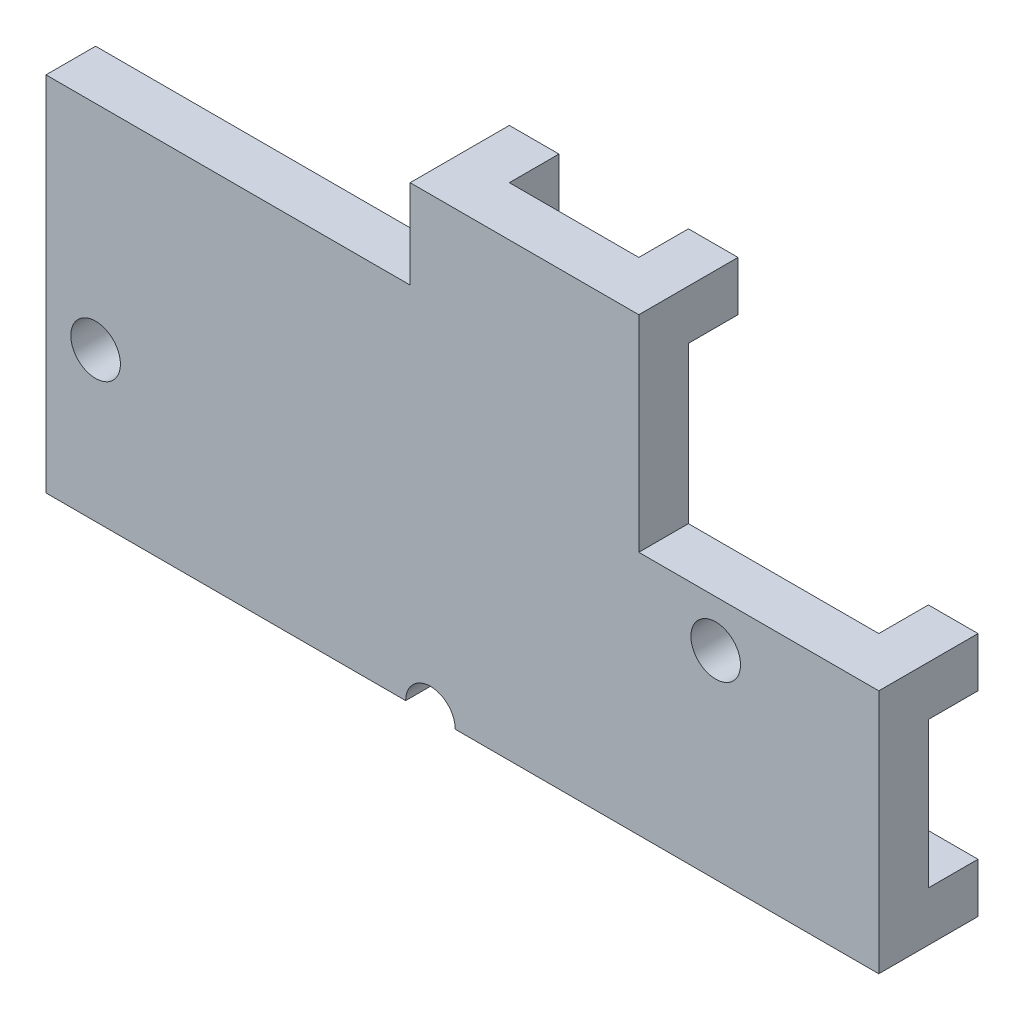
ISO-10303-21;
HEADER;
FILE_DESCRIPTION(('STEP AP214'),'2;1');
FILE_NAME('part.step','',(''),(''),'','','');
FILE_SCHEMA(('AUTOMOTIVE_DESIGN { 1 0 10303 214 1 1 1 1 }'));
ENDSEC;
DATA;
#1=APPLICATION_CONTEXT('core data for automotive mechanical design processes');
#2=APPLICATION_PROTOCOL_DEFINITION('international standard','automotive_design',2000,#1);
#3=PRODUCT_CONTEXT('',#1,'mechanical');
#4=PRODUCT('Part','Part','',(#3));
#5=PRODUCT_RELATED_PRODUCT_CATEGORY('part','',(#4));
#6=PRODUCT_DEFINITION_FORMATION('','',#4);
#7=PRODUCT_DEFINITION_CONTEXT('part definition',#1,'design');
#8=PRODUCT_DEFINITION('design','',#6,#7);
#9=PRODUCT_DEFINITION_SHAPE('','',#8);
#10=(LENGTH_UNIT() NAMED_UNIT(*) SI_UNIT(.MILLI.,.METRE.));
#11=(NAMED_UNIT(*) PLANE_ANGLE_UNIT() SI_UNIT($,.RADIAN.));
#12=(NAMED_UNIT(*) SI_UNIT($,.STERADIAN.) SOLID_ANGLE_UNIT());
#13=UNCERTAINTY_MEASURE_WITH_UNIT(LENGTH_MEASURE(1.E-05),#10,'distance_accuracy_value','');
#14=(GEOMETRIC_REPRESENTATION_CONTEXT(3) GLOBAL_UNCERTAINTY_ASSIGNED_CONTEXT((#13)) GLOBAL_UNIT_ASSIGNED_CONTEXT((#10,
#11,#12)) REPRESENTATION_CONTEXT('',''));
#15=CARTESIAN_POINT('',(0.,0.,0.));
#16=DIRECTION('',(0.,0.,1.));
#17=DIRECTION('',(1.,0.,0.));
#18=AXIS2_PLACEMENT_3D('',#15,#16,#17);
#19=CARTESIAN_POINT('',(0.,0.,0.));
#20=DIRECTION('',(0.,0.,1.));
#21=DIRECTION('',(1.,0.,0.));
#22=AXIS2_PLACEMENT_3D('',#19,#20,#21);
#23=PLANE('',#22);
#24=CARTESIAN_POINT('',(94.0727074553924,-6.0260802055856,0.));
#25=DIRECTION('',(0.,0.,-1.));
#26=DIRECTION('',(-1.,0.,0.));
#27=AXIS2_PLACEMENT_3D('',#24,#25,#26);
#28=CIRCLE('',#27,0.499999999999999);
#29=CARTESIAN_POINT('',(93.5727074553924,-6.0260802055856,0.));
#30=VERTEX_POINT('',#29);
#31=EDGE_CURVE('E279',#30,#30,#28,.T.);
#32=ORIENTED_EDGE('',*,*,#31,.F.);
#33=EDGE_LOOP('',(#32));
#34=FACE_BOUND('',#33,.T.);
#35=CARTESIAN_POINT('',(81.5727074553924,-7.0260802055856,0.));
#36=DIRECTION('',(0.,0.,-1.));
#37=DIRECTION('',(-1.,0.,0.));
#38=AXIS2_PLACEMENT_3D('',#35,#36,#37);
#39=CIRCLE('',#38,0.499999999999999);
#40=CARTESIAN_POINT('',(81.0727074553924,-7.0260802055856,0.));
#41=VERTEX_POINT('',#40);
#42=EDGE_CURVE('E296',#41,#41,#39,.T.);
#43=ORIENTED_EDGE('',*,*,#42,.F.);
#44=EDGE_LOOP('',(#43));
#45=FACE_BOUND('',#44,.T.);
#46=DIRECTION('',(0.,1.,0.));
#47=VECTOR('',#46,1.);
#48=CARTESIAN_POINT('',(96.3601074553924,-9.0260802055856,0.));
#49=LINE('',#48,#47);
#50=CARTESIAN_POINT('',(96.3601074553924,-10.0260802055856,0.));
#51=VERTEX_POINT('',#50);
#52=CARTESIAN_POINT('',(96.3601074553924,-9.0260802055856,0.));
#53=VERTEX_POINT('',#52);
#54=EDGE_CURVE('E204',#51,#53,#49,.T.);
#55=ORIENTED_EDGE('',*,*,#54,.F.);
#56=DIRECTION('',(1.,0.,0.));
#57=VECTOR('',#56,1.);
#58=CARTESIAN_POINT('',(80.5727074553924,-10.0260802055856,0.));
#59=LINE('',#58,#57);
#60=CARTESIAN_POINT('',(88.8227074553924,-10.0260802055856,0.));
#61=VERTEX_POINT('',#60);
#62=EDGE_CURVE('E355',#61,#51,#59,.T.);
#63=ORIENTED_EDGE('',*,*,#62,.F.);
#64=CARTESIAN_POINT('',(88.3227074553924,-10.0260802055856,0.));
#65=DIRECTION('',(0.,0.,-1.));
#66=DIRECTION('',(-1.,0.,0.));
#67=AXIS2_PLACEMENT_3D('',#64,#65,#66);
#68=CIRCLE('',#67,0.499999999999999);
#69=CARTESIAN_POINT('',(87.8227074553924,-10.0260802055856,0.));
#70=VERTEX_POINT('',#69);
#71=EDGE_CURVE('E284',#70,#61,#68,.T.);
#72=ORIENTED_EDGE('',*,*,#71,.F.);
#73=CARTESIAN_POINT('',(80.5727074553924,-10.0260802055856,0.));
#74=VERTEX_POINT('',#73);
#75=EDGE_CURVE('E356',#74,#70,#59,.T.);
#76=ORIENTED_EDGE('',*,*,#75,.F.);
#77=DIRECTION('',(0.,-1.,0.));
#78=VECTOR('',#77,1.);
#79=CARTESIAN_POINT('',(80.5727074553924,-2.7260802055856,0.));
#80=LINE('',#79,#78);
#81=CARTESIAN_POINT('',(80.5727074553924,-2.7260802055856,0.));
#82=VERTEX_POINT('',#81);
#83=EDGE_CURVE('E342',#82,#74,#80,.T.);
#84=ORIENTED_EDGE('',*,*,#83,.F.);
#85=DIRECTION('',(-1.,0.,0.));
#86=VECTOR('',#85,1.);
#87=CARTESIAN_POINT('',(80.5727074553924,-2.7260802055856,0.));
#88=LINE('',#87,#86);
#89=CARTESIAN_POINT('',(87.9127074553924,-2.7260802055856,0.));
#90=VERTEX_POINT('',#89);
#91=EDGE_CURVE('E347',#90,#82,#88,.T.);
#92=ORIENTED_EDGE('',*,*,#91,.F.);
#93=DIRECTION('',(0.,-1.,0.));
#94=VECTOR('',#93,1.);
#95=CARTESIAN_POINT('',(87.9127074553924,-0.938680205585596,0.));
#96=LINE('',#95,#94);
#97=CARTESIAN_POINT('',(87.9127074553924,-1.9386802055856,0.));
#98=VERTEX_POINT('',#97);
#99=EDGE_CURVE('E318',#98,#90,#96,.T.);
#100=ORIENTED_EDGE('',*,*,#99,.F.);
#101=DIRECTION('',(-1.,0.,0.));
#102=VECTOR('',#101,1.);
#103=CARTESIAN_POINT('',(87.9127074553924,-1.9386802055856,0.));
#104=LINE('',#103,#102);
#105=CARTESIAN_POINT('',(88.9127074553924,-1.9386802055856,0.));
#106=VERTEX_POINT('',#105);
#107=EDGE_CURVE('E239',#106,#98,#104,.T.);
#108=ORIENTED_EDGE('',*,*,#107,.F.);
#109=DIRECTION('',(0.,-1.,0.));
#110=VECTOR('',#109,1.);
#111=CARTESIAN_POINT('',(88.9127074553924,-1.9386802055856,0.));
#112=LINE('',#111,#110);
#113=CARTESIAN_POINT('',(88.9127074553924,-0.938680205585596,0.));
#114=VERTEX_POINT('',#113);
#115=EDGE_CURVE('E234',#114,#106,#112,.T.);
#116=ORIENTED_EDGE('',*,*,#115,.F.);
#117=DIRECTION('',(-1.,0.,0.));
#118=VECTOR('',#117,1.);
#119=CARTESIAN_POINT('',(92.5227074553924,-0.938680205585596,0.));
#120=LINE('',#119,#118);
#121=CARTESIAN_POINT('',(91.5227074553924,-0.938680205585596,0.));
#122=VERTEX_POINT('',#121);
#123=EDGE_CURVE('E305',#122,#114,#120,.T.);
#124=ORIENTED_EDGE('',*,*,#123,.F.);
#125=DIRECTION('',(0.,1.,0.));
#126=VECTOR('',#125,1.);
#127=CARTESIAN_POINT('',(91.5227074553924,-1.9386802055856,0.));
#128=LINE('',#127,#126);
#129=CARTESIAN_POINT('',(91.5227074553924,-1.9386802055856,0.));
#130=VERTEX_POINT('',#129);
#131=EDGE_CURVE('E256',#130,#122,#128,.T.);
#132=ORIENTED_EDGE('',*,*,#131,.F.);
#133=DIRECTION('',(-1.,0.,0.));
#134=VECTOR('',#133,1.);
#135=CARTESIAN_POINT('',(91.5227074553924,-1.9386802055856,0.));
#136=LINE('',#135,#134);
#137=CARTESIAN_POINT('',(92.5227074553924,-1.9386802055856,0.));
#138=VERTEX_POINT('',#137);
#139=EDGE_CURVE('E58',#138,#130,#136,.T.);
#140=ORIENTED_EDGE('',*,*,#139,.F.);
#141=DIRECTION('',(0.,-1.,0.));
#142=VECTOR('',#141,1.);
#143=CARTESIAN_POINT('',(92.5227074553924,-2.7260802055856,0.));
#144=LINE('',#143,#142);
#145=CARTESIAN_POINT('',(92.5227074553924,-5.0860802055856,0.));
#146=VERTEX_POINT('',#145);
#147=EDGE_CURVE('E331',#138,#146,#144,.T.);
#148=ORIENTED_EDGE('',*,*,#147,.T.);
#149=DIRECTION('',(1.,0.,0.));
#150=VECTOR('',#149,1.);
#151=CARTESIAN_POINT('',(95.5727074553924,-5.0860802055856,0.));
#152=LINE('',#151,#150);
#153=CARTESIAN_POINT('',(96.3601074553924,-5.0860802055856,0.));
#154=VERTEX_POINT('',#153);
#155=EDGE_CURVE('E333',#146,#154,#152,.T.);
#156=ORIENTED_EDGE('',*,*,#155,.T.);
#157=DIRECTION('',(0.,1.,0.));
#158=VECTOR('',#157,1.);
#159=CARTESIAN_POINT('',(96.3601074553924,-6.0860802055856,0.));
#160=LINE('',#159,#158);
#161=CARTESIAN_POINT('',(96.3601074553924,-6.0860802055856,0.));
#162=VERTEX_POINT('',#161);
#163=EDGE_CURVE('E206',#162,#154,#160,.T.);
#164=ORIENTED_EDGE('',*,*,#163,.F.);
#165=DIRECTION('',(-1.,0.,0.));
#166=VECTOR('',#165,1.);
#167=CARTESIAN_POINT('',(96.3601074553924,-6.0860802055856,0.));
#168=LINE('',#167,#166);
#169=CARTESIAN_POINT('',(97.3601074553924,-6.0860802055856,0.));
#170=VERTEX_POINT('',#169);
#171=EDGE_CURVE('E209',#170,#162,#168,.T.);
#172=ORIENTED_EDGE('',*,*,#171,.F.);
#173=DIRECTION('',(0.,1.,0.));
#174=VECTOR('',#173,1.);
#175=CARTESIAN_POINT('',(97.3601074553924,-10.0260802055856,0.));
#176=LINE('',#175,#174);
#177=CARTESIAN_POINT('',(97.3601074553924,-9.0260802055856,0.));
#178=VERTEX_POINT('',#177);
#179=EDGE_CURVE('E320',#178,#170,#176,.T.);
#180=ORIENTED_EDGE('',*,*,#179,.F.);
#181=DIRECTION('',(1.,0.,0.));
#182=VECTOR('',#181,1.);
#183=CARTESIAN_POINT('',(96.3601074553924,-9.0260802055856,0.));
#184=LINE('',#183,#182);
#185=EDGE_CURVE('E200',#53,#178,#184,.T.);
#186=ORIENTED_EDGE('',*,*,#185,.F.);
#187=EDGE_LOOP('',(#55,#63,#72,#76,#84,#92,#100,#108,#116,#124,#132,#140,#148,#156,#164,#172,
#180,#186));
#188=FACE_BOUND('',#187,.T.);
#189=ADVANCED_FACE('F35',(#34,#45,#188),#23,.F.);
#190=CARTESIAN_POINT('',(80.5727074553924,-10.0260802055856,1.));
#191=DIRECTION('',(0.,1.,0.));
#192=DIRECTION('',(0.,0.,1.));
#193=AXIS2_PLACEMENT_3D('',#190,#191,#192);
#194=PLANE('',#193);
#195=DIRECTION('',(1.,0.,0.));
#196=VECTOR('',#195,1.);
#197=CARTESIAN_POINT('',(80.5727074553924,-10.0260802055856,1.));
#198=LINE('',#197,#196);
#199=CARTESIAN_POINT('',(88.8227074553924,-10.0260802055856,1.));
#200=VERTEX_POINT('',#199);
#201=CARTESIAN_POINT('',(97.3601074553924,-10.0260802055856,1.));
#202=VERTEX_POINT('',#201);
#203=EDGE_CURVE('E346',#200,#202,#198,.T.);
#204=ORIENTED_EDGE('',*,*,#203,.F.);
#205=DIRECTION('',(0.,0.,-1.));
#206=VECTOR('',#205,1.);
#207=CARTESIAN_POINT('',(88.8227074553924,-10.0260802055856,1.));
#208=LINE('',#207,#206);
#209=EDGE_CURVE('E293',#200,#61,#208,.T.);
#210=ORIENTED_EDGE('',*,*,#209,.T.);
#211=ORIENTED_EDGE('',*,*,#62,.T.);
#212=DIRECTION('',(0.,0.,1.));
#213=VECTOR('',#212,1.);
#214=CARTESIAN_POINT('',(96.3601074553924,-10.0260802055856,-1.));
#215=LINE('',#214,#213);
#216=CARTESIAN_POINT('',(96.3601074553924,-10.0260802055856,-1.));
#217=VERTEX_POINT('',#216);
#218=EDGE_CURVE('E211',#217,#51,#215,.T.);
#219=ORIENTED_EDGE('',*,*,#218,.F.);
#220=DIRECTION('',(-1.,0.,0.));
#221=VECTOR('',#220,1.);
#222=CARTESIAN_POINT('',(96.3601074553924,-10.0260802055856,-1.));
#223=LINE('',#222,#221);
#224=CARTESIAN_POINT('',(97.3601074553924,-10.0260802055856,-1.));
#225=VERTEX_POINT('',#224);
#226=EDGE_CURVE('E197',#225,#217,#223,.T.);
#227=ORIENTED_EDGE('',*,*,#226,.F.);
#228=DIRECTION('',(0.,0.,-1.));
#229=VECTOR('',#228,1.);
#230=CARTESIAN_POINT('',(97.3601074553924,-10.0260802055856,0.));
#231=LINE('',#230,#229);
#232=EDGE_CURVE('E328',#202,#225,#231,.T.);
#233=ORIENTED_EDGE('',*,*,#232,.F.);
#234=EDGE_LOOP('',(#204,#210,#211,#219,#227,#233));
#235=FACE_BOUND('',#234,.T.);
#236=ADVANCED_FACE('F440',(#235),#194,.F.);
#237=CARTESIAN_POINT('',(80.5727074553924,-2.7260802055856,1.));
#238=DIRECTION('',(0.,-1.,0.));
#239=DIRECTION('',(1.,0.,0.));
#240=AXIS2_PLACEMENT_3D('',#237,#238,#239);
#241=PLANE('',#240);
#242=DIRECTION('',(0.,0.,1.));
#243=VECTOR('',#242,1.);
#244=CARTESIAN_POINT('',(87.9127074553924,-2.7260802055856,0.));
#245=LINE('',#244,#243);
#246=CARTESIAN_POINT('',(87.9127074553924,-2.7260802055856,1.));
#247=VERTEX_POINT('',#246);
#248=EDGE_CURVE('E300',#90,#247,#245,.T.);
#249=ORIENTED_EDGE('',*,*,#248,.F.);
#250=ORIENTED_EDGE('',*,*,#91,.T.);
#251=DIRECTION('',(0.,0.,-1.));
#252=VECTOR('',#251,1.);
#253=CARTESIAN_POINT('',(80.5727074553924,-2.7260802055856,1.));
#254=LINE('',#253,#252);
#255=CARTESIAN_POINT('',(80.5727074553924,-2.7260802055856,1.));
#256=VERTEX_POINT('',#255);
#257=EDGE_CURVE('E43',#256,#82,#254,.T.);
#258=ORIENTED_EDGE('',*,*,#257,.F.);
#259=DIRECTION('',(-1.,0.,0.));
#260=VECTOR('',#259,1.);
#261=CARTESIAN_POINT('',(80.5727074553924,-2.7260802055856,1.));
#262=LINE('',#261,#260);
#263=EDGE_CURVE('E351',#247,#256,#262,.T.);
#264=ORIENTED_EDGE('',*,*,#263,.F.);
#265=EDGE_LOOP('',(#249,#250,#258,#264));
#266=FACE_BOUND('',#265,.T.);
#267=ADVANCED_FACE('F378',(#266),#241,.F.);
#268=CARTESIAN_POINT('',(80.5727074553924,-2.7260802055856,1.));
#269=DIRECTION('',(1.,0.,0.));
#270=DIRECTION('',(0.,0.,-1.));
#271=AXIS2_PLACEMENT_3D('',#268,#269,#270);
#272=PLANE('',#271);
#273=ORIENTED_EDGE('',*,*,#83,.T.);
#274=DIRECTION('',(0.,0.,-1.));
#275=VECTOR('',#274,1.);
#276=CARTESIAN_POINT('',(80.5727074553924,-10.0260802055856,1.));
#277=LINE('',#276,#275);
#278=CARTESIAN_POINT('',(80.5727074553924,-10.0260802055856,1.));
#279=VERTEX_POINT('',#278);
#280=EDGE_CURVE('E11',#279,#74,#277,.T.);
#281=ORIENTED_EDGE('',*,*,#280,.F.);
#282=DIRECTION('',(0.,-1.,0.));
#283=VECTOR('',#282,1.);
#284=CARTESIAN_POINT('',(80.5727074553924,-2.7260802055856,1.));
#285=LINE('',#284,#283);
#286=EDGE_CURVE('E343',#256,#279,#285,.T.);
#287=ORIENTED_EDGE('',*,*,#286,.F.);
#288=ORIENTED_EDGE('',*,*,#257,.T.);
#289=EDGE_LOOP('',(#273,#281,#287,#288));
#290=FACE_BOUND('',#289,.T.);
#291=ADVANCED_FACE('F37',(#290),#272,.F.);
#292=ORIENTED_EDGE('',*,*,#75,.T.);
#293=DIRECTION('',(0.,0.,-1.));
#294=VECTOR('',#293,1.);
#295=CARTESIAN_POINT('',(87.8227074553924,-10.0260802055856,1.));
#296=LINE('',#295,#294);
#297=CARTESIAN_POINT('',(87.8227074553924,-10.0260802055856,1.));
#298=VERTEX_POINT('',#297);
#299=EDGE_CURVE('E283',#70,#298,#296,.F.);
#300=ORIENTED_EDGE('',*,*,#299,.T.);
#301=EDGE_CURVE('E348',#279,#298,#198,.T.);
#302=ORIENTED_EDGE('',*,*,#301,.F.);
#303=ORIENTED_EDGE('',*,*,#280,.T.);
#304=EDGE_LOOP('',(#292,#300,#302,#303));
#305=FACE_BOUND('',#304,.T.);
#306=ADVANCED_FACE('F371',(#305),#194,.F.);
#307=CARTESIAN_POINT('',(0.,0.,1.));
#308=DIRECTION('',(0.,0.,1.));
#309=DIRECTION('',(1.,0.,0.));
#310=AXIS2_PLACEMENT_3D('',#307,#308,#309);
#311=PLANE('',#310);
#312=CARTESIAN_POINT('',(88.3227074553924,-10.0260802055856,1.));
#313=DIRECTION('',(0.,0.,-1.));
#314=DIRECTION('',(-1.,0.,0.));
#315=AXIS2_PLACEMENT_3D('',#312,#313,#314);
#316=CIRCLE('',#315,0.499999999999999);
#317=EDGE_CURVE('E280',#298,#200,#316,.T.);
#318=ORIENTED_EDGE('',*,*,#317,.T.);
#319=ORIENTED_EDGE('',*,*,#203,.T.);
#320=DIRECTION('',(0.,-1.,0.));
#321=VECTOR('',#320,1.);
#322=CARTESIAN_POINT('',(97.3601074553924,-10.0260802055856,1.));
#323=LINE('',#322,#321);
#324=CARTESIAN_POINT('',(97.3601074553924,-5.0860802055856,1.));
#325=VERTEX_POINT('',#324);
#326=EDGE_CURVE('E325',#325,#202,#323,.T.);
#327=ORIENTED_EDGE('',*,*,#326,.F.);
#328=DIRECTION('',(1.,0.,0.));
#329=VECTOR('',#328,1.);
#330=CARTESIAN_POINT('',(95.5727074553924,-5.0860802055856,1.));
#331=LINE('',#330,#329);
#332=CARTESIAN_POINT('',(92.5227074553924,-5.0860802055856,1.));
#333=VERTEX_POINT('',#332);
#334=EDGE_CURVE('E334',#333,#325,#331,.T.);
#335=ORIENTED_EDGE('',*,*,#334,.F.);
#336=DIRECTION('',(0.,-1.,0.));
#337=VECTOR('',#336,1.);
#338=CARTESIAN_POINT('',(92.5227074553924,-2.7260802055856,1.));
#339=LINE('',#338,#337);
#340=CARTESIAN_POINT('',(92.5227074553924,-0.938680205585596,1.));
#341=VERTEX_POINT('',#340);
#342=EDGE_CURVE('E330',#341,#333,#339,.T.);
#343=ORIENTED_EDGE('',*,*,#342,.F.);
#344=DIRECTION('',(1.,0.,0.));
#345=VECTOR('',#344,1.);
#346=CARTESIAN_POINT('',(92.5227074553924,-0.938680205585596,1.));
#347=LINE('',#346,#345);
#348=CARTESIAN_POINT('',(87.9127074553924,-0.938680205585596,1.));
#349=VERTEX_POINT('',#348);
#350=EDGE_CURVE('E310',#349,#341,#347,.T.);
#351=ORIENTED_EDGE('',*,*,#350,.F.);
#352=DIRECTION('',(0.,-1.,0.));
#353=VECTOR('',#352,1.);
#354=CARTESIAN_POINT('',(87.9127074553924,-0.938680205585596,1.));
#355=LINE('',#354,#353);
#356=EDGE_CURVE('E313',#349,#247,#355,.T.);
#357=ORIENTED_EDGE('',*,*,#356,.T.);
#358=ORIENTED_EDGE('',*,*,#263,.T.);
#359=ORIENTED_EDGE('',*,*,#286,.T.);
#360=ORIENTED_EDGE('',*,*,#301,.T.);
#361=EDGE_LOOP('',(#318,#319,#327,#335,#343,#351,#357,#358,#359,#360));
#362=FACE_BOUND('',#361,.T.);
#363=CARTESIAN_POINT('',(94.0727074553924,-6.0260802055856,1.));
#364=DIRECTION('',(0.,0.,-1.));
#365=DIRECTION('',(-1.,0.,0.));
#366=AXIS2_PLACEMENT_3D('',#363,#364,#365);
#367=CIRCLE('',#366,0.499999999999999);
#368=CARTESIAN_POINT('',(93.5727074553924,-6.0260802055856,1.));
#369=VERTEX_POINT('',#368);
#370=EDGE_CURVE('E286',#369,#369,#367,.T.);
#371=ORIENTED_EDGE('',*,*,#370,.T.);
#372=EDGE_LOOP('',(#371));
#373=FACE_BOUND('',#372,.T.);
#374=CARTESIAN_POINT('',(81.5727074553924,-7.0260802055856,1.));
#375=DIRECTION('',(0.,0.,-1.));
#376=DIRECTION('',(-1.,0.,0.));
#377=AXIS2_PLACEMENT_3D('',#374,#375,#376);
#378=CIRCLE('',#377,0.499999999999999);
#379=CARTESIAN_POINT('',(81.0727074553924,-7.0260802055856,1.));
#380=VERTEX_POINT('',#379);
#381=EDGE_CURVE('E297',#380,#380,#378,.T.);
#382=ORIENTED_EDGE('',*,*,#381,.T.);
#383=EDGE_LOOP('',(#382));
#384=FACE_BOUND('',#383,.T.);
#385=ADVANCED_FACE('F373',(#362,#373,#384),#311,.T.);
#386=CARTESIAN_POINT('',(95.5727074553924,-5.0860802055856,0.));
#387=DIRECTION('',(0.,-1.,0.));
#388=DIRECTION('',(0.,0.,-1.));
#389=AXIS2_PLACEMENT_3D('',#386,#387,#388);
#390=PLANE('',#389);
#391=ORIENTED_EDGE('',*,*,#334,.T.);
#392=DIRECTION('',(0.,0.,1.));
#393=VECTOR('',#392,1.);
#394=CARTESIAN_POINT('',(97.3601074553924,-5.0860802055856,0.));
#395=LINE('',#394,#393);
#396=CARTESIAN_POINT('',(97.3601074553924,-5.0860802055856,-1.));
#397=VERTEX_POINT('',#396);
#398=EDGE_CURVE('E322',#397,#325,#395,.T.);
#399=ORIENTED_EDGE('',*,*,#398,.F.);
#400=DIRECTION('',(1.,0.,0.));
#401=VECTOR('',#400,1.);
#402=CARTESIAN_POINT('',(96.3601074553924,-5.0860802055856,-1.));
#403=LINE('',#402,#401);
#404=CARTESIAN_POINT('',(96.3601074553924,-5.0860802055856,-1.));
#405=VERTEX_POINT('',#404);
#406=EDGE_CURVE('E218',#405,#397,#403,.T.);
#407=ORIENTED_EDGE('',*,*,#406,.F.);
#408=DIRECTION('',(0.,0.,1.));
#409=VECTOR('',#408,1.);
#410=CARTESIAN_POINT('',(96.3601074553924,-5.0860802055856,-1.));
#411=LINE('',#410,#409);
#412=EDGE_CURVE('E232',#405,#154,#411,.T.);
#413=ORIENTED_EDGE('',*,*,#412,.T.);
#414=ORIENTED_EDGE('',*,*,#155,.F.);
#415=DIRECTION('',(0.,0.,1.));
#416=VECTOR('',#415,1.);
#417=CARTESIAN_POINT('',(92.5227074553924,-5.0860802055856,0.));
#418=LINE('',#417,#416);
#419=EDGE_CURVE('E337',#146,#333,#418,.T.);
#420=ORIENTED_EDGE('',*,*,#419,.T.);
#421=EDGE_LOOP('',(#391,#399,#407,#413,#414,#420));
#422=FACE_BOUND('',#421,.T.);
#423=ADVANCED_FACE('F414',(#422),#390,.F.);
#424=CARTESIAN_POINT('',(92.5227074553924,-2.7260802055856,0.));
#425=DIRECTION('',(-1.,0.,0.));
#426=DIRECTION('',(0.,0.,1.));
#427=AXIS2_PLACEMENT_3D('',#424,#425,#426);
#428=PLANE('',#427);
#429=ORIENTED_EDGE('',*,*,#342,.T.);
#430=ORIENTED_EDGE('',*,*,#419,.F.);
#431=ORIENTED_EDGE('',*,*,#147,.F.);
#432=DIRECTION('',(0.,0.,1.));
#433=VECTOR('',#432,1.);
#434=CARTESIAN_POINT('',(92.5227074553924,-1.9386802055856,-1.));
#435=LINE('',#434,#433);
#436=CARTESIAN_POINT('',(92.5227074553924,-1.9386802055856,-1.));
#437=VERTEX_POINT('',#436);
#438=EDGE_CURVE('E273',#437,#138,#435,.T.);
#439=ORIENTED_EDGE('',*,*,#438,.F.);
#440=DIRECTION('',(0.,-1.,0.));
#441=VECTOR('',#440,1.);
#442=CARTESIAN_POINT('',(92.5227074553924,-1.9386802055856,-1.));
#443=LINE('',#442,#441);
#444=CARTESIAN_POINT('',(92.5227074553924,-0.938680205585596,-1.));
#445=VERTEX_POINT('',#444);
#446=EDGE_CURVE('E263',#445,#437,#443,.T.);
#447=ORIENTED_EDGE('',*,*,#446,.F.);
#448=DIRECTION('',(0.,0.,-1.));
#449=VECTOR('',#448,1.);
#450=CARTESIAN_POINT('',(92.5227074553924,-0.938680205585596,0.));
#451=LINE('',#450,#449);
#452=EDGE_CURVE('E303',#341,#445,#451,.T.);
#453=ORIENTED_EDGE('',*,*,#452,.F.);
#454=EDGE_LOOP('',(#429,#430,#431,#439,#447,#453));
#455=FACE_BOUND('',#454,.T.);
#456=ADVANCED_FACE('F409',(#455),#428,.F.);
#457=CARTESIAN_POINT('',(97.3601074553924,0.,0.));
#458=DIRECTION('',(1.,0.,0.));
#459=DIRECTION('',(0.,0.,-1.));
#460=AXIS2_PLACEMENT_3D('',#457,#458,#459);
#461=PLANE('',#460);
#462=ORIENTED_EDGE('',*,*,#232,.T.);
#463=DIRECTION('',(0.,-1.,0.));
#464=VECTOR('',#463,1.);
#465=CARTESIAN_POINT('',(97.3601074553924,-9.0260802055856,-1.));
#466=LINE('',#465,#464);
#467=CARTESIAN_POINT('',(97.3601074553924,-9.0260802055856,-1.));
#468=VERTEX_POINT('',#467);
#469=EDGE_CURVE('E191',#468,#225,#466,.T.);
#470=ORIENTED_EDGE('',*,*,#469,.F.);
#471=DIRECTION('',(0.,0.,1.));
#472=VECTOR('',#471,1.);
#473=CARTESIAN_POINT('',(97.3601074553924,-9.0260802055856,-1.));
#474=LINE('',#473,#472);
#475=EDGE_CURVE('E50',#468,#178,#474,.T.);
#476=ORIENTED_EDGE('',*,*,#475,.T.);
#477=ORIENTED_EDGE('',*,*,#179,.T.);
#478=DIRECTION('',(0.,0.,1.));
#479=VECTOR('',#478,1.);
#480=CARTESIAN_POINT('',(97.3601074553924,-6.0860802055856,-1.));
#481=LINE('',#480,#479);
#482=CARTESIAN_POINT('',(97.3601074553924,-6.0860802055856,-1.));
#483=VERTEX_POINT('',#482);
#484=EDGE_CURVE('E229',#483,#170,#481,.T.);
#485=ORIENTED_EDGE('',*,*,#484,.F.);
#486=DIRECTION('',(0.,-1.,0.));
#487=VECTOR('',#486,1.);
#488=CARTESIAN_POINT('',(97.3601074553924,-6.0860802055856,-1.));
#489=LINE('',#488,#487);
#490=EDGE_CURVE('E221',#397,#483,#489,.T.);
#491=ORIENTED_EDGE('',*,*,#490,.F.);
#492=ORIENTED_EDGE('',*,*,#398,.T.);
#493=ORIENTED_EDGE('',*,*,#326,.T.);
#494=EDGE_LOOP('',(#462,#470,#476,#477,#485,#491,#492,#493));
#495=FACE_BOUND('',#494,.T.);
#496=ADVANCED_FACE('F427',(#495),#461,.T.);
#497=CARTESIAN_POINT('',(87.9127074553924,-0.938680205585596,0.));
#498=DIRECTION('',(1.,0.,0.));
#499=DIRECTION('',(0.,1.,0.));
#500=AXIS2_PLACEMENT_3D('',#497,#498,#499);
#501=PLANE('',#500);
#502=ORIENTED_EDGE('',*,*,#248,.T.);
#503=ORIENTED_EDGE('',*,*,#356,.F.);
#504=DIRECTION('',(0.,0.,1.));
#505=VECTOR('',#504,1.);
#506=CARTESIAN_POINT('',(87.9127074553924,-0.938680205585596,0.));
#507=LINE('',#506,#505);
#508=CARTESIAN_POINT('',(87.9127074553924,-0.938680205585596,-1.));
#509=VERTEX_POINT('',#508);
#510=EDGE_CURVE('E308',#509,#349,#507,.T.);
#511=ORIENTED_EDGE('',*,*,#510,.F.);
#512=DIRECTION('',(0.,1.,0.));
#513=VECTOR('',#512,1.);
#514=CARTESIAN_POINT('',(87.9127074553924,-1.9386802055856,-1.));
#515=LINE('',#514,#513);
#516=CARTESIAN_POINT('',(87.9127074553924,-1.9386802055856,-1.));
#517=VERTEX_POINT('',#516);
#518=EDGE_CURVE('E241',#517,#509,#515,.T.);
#519=ORIENTED_EDGE('',*,*,#518,.F.);
#520=DIRECTION('',(0.,0.,1.));
#521=VECTOR('',#520,1.);
#522=CARTESIAN_POINT('',(87.9127074553924,-1.9386802055856,-1.));
#523=LINE('',#522,#521);
#524=EDGE_CURVE('E251',#517,#98,#523,.T.);
#525=ORIENTED_EDGE('',*,*,#524,.T.);
#526=ORIENTED_EDGE('',*,*,#99,.T.);
#527=EDGE_LOOP('',(#502,#503,#511,#519,#525,#526));
#528=FACE_BOUND('',#527,.T.);
#529=ADVANCED_FACE('F380',(#528),#501,.F.);
#530=CARTESIAN_POINT('',(0.,-0.938680205585596,0.));
#531=DIRECTION('',(0.,-1.,0.));
#532=DIRECTION('',(0.,0.,-1.));
#533=AXIS2_PLACEMENT_3D('',#530,#531,#532);
#534=PLANE('',#533);
#535=ORIENTED_EDGE('',*,*,#452,.T.);
#536=DIRECTION('',(1.,0.,0.));
#537=VECTOR('',#536,1.);
#538=CARTESIAN_POINT('',(91.5227074553924,-0.938680205585596,-1.));
#539=LINE('',#538,#537);
#540=CARTESIAN_POINT('',(91.5227074553924,-0.938680205585596,-1.));
#541=VERTEX_POINT('',#540);
#542=EDGE_CURVE('E260',#541,#445,#539,.T.);
#543=ORIENTED_EDGE('',*,*,#542,.F.);
#544=DIRECTION('',(0.,0.,1.));
#545=VECTOR('',#544,1.);
#546=CARTESIAN_POINT('',(91.5227074553924,-0.938680205585596,-1.));
#547=LINE('',#546,#545);
#548=EDGE_CURVE('E276',#541,#122,#547,.T.);
#549=ORIENTED_EDGE('',*,*,#548,.T.);
#550=ORIENTED_EDGE('',*,*,#123,.T.);
#551=DIRECTION('',(0.,0.,1.));
#552=VECTOR('',#551,1.);
#553=CARTESIAN_POINT('',(88.9127074553924,-0.938680205585596,-1.));
#554=LINE('',#553,#552);
#555=CARTESIAN_POINT('',(88.9127074553924,-0.938680205585596,-1.));
#556=VERTEX_POINT('',#555);
#557=EDGE_CURVE('E246',#556,#114,#554,.T.);
#558=ORIENTED_EDGE('',*,*,#557,.F.);
#559=DIRECTION('',(1.,0.,0.));
#560=VECTOR('',#559,1.);
#561=CARTESIAN_POINT('',(87.9127074553924,-0.938680205585596,-1.));
#562=LINE('',#561,#560);
#563=EDGE_CURVE('E244',#509,#556,#562,.T.);
#564=ORIENTED_EDGE('',*,*,#563,.F.);
#565=ORIENTED_EDGE('',*,*,#510,.T.);
#566=ORIENTED_EDGE('',*,*,#350,.T.);
#567=EDGE_LOOP('',(#535,#543,#549,#550,#558,#564,#565,#566));
#568=FACE_BOUND('',#567,.T.);
#569=ADVANCED_FACE('F394',(#568),#534,.F.);
#570=CARTESIAN_POINT('',(81.5727074553924,-7.0260802055856,1.));
#571=DIRECTION('',(0.,0.,-1.));
#572=DIRECTION('',(-1.,0.,0.));
#573=AXIS2_PLACEMENT_3D('',#570,#571,#572);
#574=CYLINDRICAL_SURFACE('',#573,0.499999999999999);
#575=ORIENTED_EDGE('',*,*,#381,.F.);
#576=EDGE_LOOP('',(#575));
#577=FACE_BOUND('',#576,.T.);
#578=ORIENTED_EDGE('',*,*,#42,.T.);
#579=EDGE_LOOP('',(#578));
#580=FACE_BOUND('',#579,.T.);
#581=ADVANCED_FACE('F517',(#577,#580),#574,.F.);
#582=CARTESIAN_POINT('',(94.0727074553924,-6.0260802055856,1.));
#583=DIRECTION('',(0.,0.,-1.));
#584=DIRECTION('',(-1.,0.,0.));
#585=AXIS2_PLACEMENT_3D('',#582,#583,#584);
#586=CYLINDRICAL_SURFACE('',#585,0.499999999999999);
#587=ORIENTED_EDGE('',*,*,#370,.F.);
#588=EDGE_LOOP('',(#587));
#589=FACE_BOUND('',#588,.T.);
#590=ORIENTED_EDGE('',*,*,#31,.T.);
#591=EDGE_LOOP('',(#590));
#592=FACE_BOUND('',#591,.T.);
#593=ADVANCED_FACE('F616',(#589,#592),#586,.F.);
#594=CARTESIAN_POINT('',(88.3227074553924,-10.0260802055856,1.));
#595=DIRECTION('',(0.,0.,-1.));
#596=DIRECTION('',(-1.,0.,0.));
#597=AXIS2_PLACEMENT_3D('',#594,#595,#596);
#598=CYLINDRICAL_SURFACE('',#597,0.499999999999999);
#599=ORIENTED_EDGE('',*,*,#317,.F.);
#600=ORIENTED_EDGE('',*,*,#299,.F.);
#601=ORIENTED_EDGE('',*,*,#71,.T.);
#602=ORIENTED_EDGE('',*,*,#209,.F.);
#603=EDGE_LOOP('',(#599,#600,#601,#602));
#604=FACE_BOUND('',#603,.T.);
#605=ADVANCED_FACE('F527',(#604),#598,.F.);
#606=CARTESIAN_POINT('',(91.5227074553924,-1.9386802055856,-1.));
#607=DIRECTION('',(1.,0.,0.));
#608=DIRECTION('',(0.,0.,-1.));
#609=AXIS2_PLACEMENT_3D('',#606,#607,#608);
#610=PLANE('',#609);
#611=ORIENTED_EDGE('',*,*,#131,.T.);
#612=ORIENTED_EDGE('',*,*,#548,.F.);
#613=DIRECTION('',(0.,1.,0.));
#614=VECTOR('',#613,1.);
#615=CARTESIAN_POINT('',(91.5227074553924,-1.9386802055856,-1.));
#616=LINE('',#615,#614);
#617=CARTESIAN_POINT('',(91.5227074553924,-1.9386802055856,-1.));
#618=VERTEX_POINT('',#617);
#619=EDGE_CURVE('E257',#618,#541,#616,.T.);
#620=ORIENTED_EDGE('',*,*,#619,.F.);
#621=DIRECTION('',(0.,0.,1.));
#622=VECTOR('',#621,1.);
#623=CARTESIAN_POINT('',(91.5227074553924,-1.9386802055856,-1.));
#624=LINE('',#623,#622);
#625=EDGE_CURVE('E267',#618,#130,#624,.T.);
#626=ORIENTED_EDGE('',*,*,#625,.T.);
#627=EDGE_LOOP('',(#611,#612,#620,#626));
#628=FACE_BOUND('',#627,.T.);
#629=ADVANCED_FACE('F403',(#628),#610,.F.);
#630=CARTESIAN_POINT('',(91.5227074553924,-1.9386802055856,-1.));
#631=DIRECTION('',(0.,1.,0.));
#632=DIRECTION('',(-1.,0.,0.));
#633=AXIS2_PLACEMENT_3D('',#630,#631,#632);
#634=PLANE('',#633);
#635=ORIENTED_EDGE('',*,*,#139,.T.);
#636=ORIENTED_EDGE('',*,*,#625,.F.);
#637=DIRECTION('',(-1.,0.,0.));
#638=VECTOR('',#637,1.);
#639=CARTESIAN_POINT('',(91.5227074553924,-1.9386802055856,-1.));
#640=LINE('',#639,#638);
#641=EDGE_CURVE('E265',#437,#618,#640,.T.);
#642=ORIENTED_EDGE('',*,*,#641,.F.);
#643=ORIENTED_EDGE('',*,*,#438,.T.);
#644=EDGE_LOOP('',(#635,#636,#642,#643));
#645=FACE_BOUND('',#644,.T.);
#646=ADVANCED_FACE('F399',(#645),#634,.F.);
#647=CARTESIAN_POINT('',(0.,0.,-1.));
#648=DIRECTION('',(0.,0.,-1.));
#649=DIRECTION('',(-1.,0.,0.));
#650=AXIS2_PLACEMENT_3D('',#647,#648,#649);
#651=PLANE('',#650);
#652=ORIENTED_EDGE('',*,*,#619,.T.);
#653=ORIENTED_EDGE('',*,*,#542,.T.);
#654=ORIENTED_EDGE('',*,*,#446,.T.);
#655=ORIENTED_EDGE('',*,*,#641,.T.);
#656=EDGE_LOOP('',(#652,#653,#654,#655));
#657=FACE_BOUND('',#656,.T.);
#658=ADVANCED_FACE('F405',(#657),#651,.T.);
#659=CARTESIAN_POINT('',(88.9127074553924,-1.9386802055856,-1.));
#660=DIRECTION('',(-1.,0.,0.));
#661=DIRECTION('',(0.,0.,1.));
#662=AXIS2_PLACEMENT_3D('',#659,#660,#661);
#663=PLANE('',#662);
#664=ORIENTED_EDGE('',*,*,#115,.T.);
#665=DIRECTION('',(0.,0.,1.));
#666=VECTOR('',#665,1.);
#667=CARTESIAN_POINT('',(88.9127074553924,-1.9386802055856,-1.));
#668=LINE('',#667,#666);
#669=CARTESIAN_POINT('',(88.9127074553924,-1.9386802055856,-1.));
#670=VERTEX_POINT('',#669);
#671=EDGE_CURVE('E254',#670,#106,#668,.T.);
#672=ORIENTED_EDGE('',*,*,#671,.F.);
#673=DIRECTION('',(0.,-1.,0.));
#674=VECTOR('',#673,1.);
#675=CARTESIAN_POINT('',(88.9127074553924,-1.9386802055856,-1.));
#676=LINE('',#675,#674);
#677=EDGE_CURVE('E235',#556,#670,#676,.T.);
#678=ORIENTED_EDGE('',*,*,#677,.F.);
#679=ORIENTED_EDGE('',*,*,#557,.T.);
#680=EDGE_LOOP('',(#664,#672,#678,#679));
#681=FACE_BOUND('',#680,.T.);
#682=ADVANCED_FACE('F390',(#681),#663,.F.);
#683=CARTESIAN_POINT('',(87.9127074553924,-1.9386802055856,-1.));
#684=DIRECTION('',(0.,1.,0.));
#685=DIRECTION('',(0.,0.,1.));
#686=AXIS2_PLACEMENT_3D('',#683,#684,#685);
#687=PLANE('',#686);
#688=ORIENTED_EDGE('',*,*,#107,.T.);
#689=ORIENTED_EDGE('',*,*,#524,.F.);
#690=DIRECTION('',(-1.,0.,0.));
#691=VECTOR('',#690,1.);
#692=CARTESIAN_POINT('',(87.9127074553924,-1.9386802055856,-1.));
#693=LINE('',#692,#691);
#694=EDGE_CURVE('E238',#670,#517,#693,.T.);
#695=ORIENTED_EDGE('',*,*,#694,.F.);
#696=ORIENTED_EDGE('',*,*,#671,.T.);
#697=EDGE_LOOP('',(#688,#689,#695,#696));
#698=FACE_BOUND('',#697,.T.);
#699=ADVANCED_FACE('F386',(#698),#687,.F.);
#700=CARTESIAN_POINT('',(0.,0.,-1.));
#701=DIRECTION('',(0.,0.,-1.));
#702=DIRECTION('',(-1.,0.,0.));
#703=AXIS2_PLACEMENT_3D('',#700,#701,#702);
#704=PLANE('',#703);
#705=ORIENTED_EDGE('',*,*,#677,.T.);
#706=ORIENTED_EDGE('',*,*,#694,.T.);
#707=ORIENTED_EDGE('',*,*,#518,.T.);
#708=ORIENTED_EDGE('',*,*,#563,.T.);
#709=EDGE_LOOP('',(#705,#706,#707,#708));
#710=FACE_BOUND('',#709,.T.);
#711=ADVANCED_FACE('F561',(#710),#704,.T.);
#712=CARTESIAN_POINT('',(96.3601074553924,-6.0860802055856,-1.));
#713=DIRECTION('',(1.,0.,0.));
#714=DIRECTION('',(0.,0.,-1.));
#715=AXIS2_PLACEMENT_3D('',#712,#713,#714);
#716=PLANE('',#715);
#717=ORIENTED_EDGE('',*,*,#163,.T.);
#718=ORIENTED_EDGE('',*,*,#412,.F.);
#719=DIRECTION('',(0.,1.,0.));
#720=VECTOR('',#719,1.);
#721=CARTESIAN_POINT('',(96.3601074553924,-6.0860802055856,-1.));
#722=LINE('',#721,#720);
#723=CARTESIAN_POINT('',(96.3601074553924,-6.0860802055856,-1.));
#724=VERTEX_POINT('',#723);
#725=EDGE_CURVE('E215',#724,#405,#722,.T.);
#726=ORIENTED_EDGE('',*,*,#725,.F.);
#727=DIRECTION('',(0.,0.,1.));
#728=VECTOR('',#727,1.);
#729=CARTESIAN_POINT('',(96.3601074553924,-6.0860802055856,-1.));
#730=LINE('',#729,#728);
#731=EDGE_CURVE('E224',#724,#162,#730,.T.);
#732=ORIENTED_EDGE('',*,*,#731,.T.);
#733=EDGE_LOOP('',(#717,#718,#726,#732));
#734=FACE_BOUND('',#733,.T.);
#735=ADVANCED_FACE('F418',(#734),#716,.F.);
#736=CARTESIAN_POINT('',(96.3601074553924,-6.0860802055856,-1.));
#737=DIRECTION('',(0.,1.,0.));
#738=DIRECTION('',(0.,0.,1.));
#739=AXIS2_PLACEMENT_3D('',#736,#737,#738);
#740=PLANE('',#739);
#741=ORIENTED_EDGE('',*,*,#171,.T.);
#742=ORIENTED_EDGE('',*,*,#731,.F.);
#743=DIRECTION('',(-1.,0.,0.));
#744=VECTOR('',#743,1.);
#745=CARTESIAN_POINT('',(96.3601074553924,-6.0860802055856,-1.));
#746=LINE('',#745,#744);
#747=EDGE_CURVE('E223',#483,#724,#746,.T.);
#748=ORIENTED_EDGE('',*,*,#747,.F.);
#749=ORIENTED_EDGE('',*,*,#484,.T.);
#750=EDGE_LOOP('',(#741,#742,#748,#749));
#751=FACE_BOUND('',#750,.T.);
#752=ADVANCED_FACE('F423',(#751),#740,.F.);
#753=CARTESIAN_POINT('',(0.,0.,-1.));
#754=DIRECTION('',(0.,0.,-1.));
#755=DIRECTION('',(-1.,0.,0.));
#756=AXIS2_PLACEMENT_3D('',#753,#754,#755);
#757=PLANE('',#756);
#758=ORIENTED_EDGE('',*,*,#725,.T.);
#759=ORIENTED_EDGE('',*,*,#406,.T.);
#760=ORIENTED_EDGE('',*,*,#490,.T.);
#761=ORIENTED_EDGE('',*,*,#747,.T.);
#762=EDGE_LOOP('',(#758,#759,#760,#761));
#763=FACE_BOUND('',#762,.T.);
#764=ADVANCED_FACE('F430',(#763),#757,.T.);
#765=CARTESIAN_POINT('',(96.3601074553924,-9.0260802055856,-1.));
#766=DIRECTION('',(1.,0.,0.));
#767=DIRECTION('',(0.,0.,-1.));
#768=AXIS2_PLACEMENT_3D('',#765,#766,#767);
#769=PLANE('',#768);
#770=ORIENTED_EDGE('',*,*,#54,.T.);
#771=DIRECTION('',(0.,0.,1.));
#772=VECTOR('',#771,1.);
#773=CARTESIAN_POINT('',(96.3601074553924,-9.0260802055856,-1.));
#774=LINE('',#773,#772);
#775=CARTESIAN_POINT('',(96.3601074553924,-9.0260802055856,-1.));
#776=VERTEX_POINT('',#775);
#777=EDGE_CURVE('E187',#776,#53,#774,.T.);
#778=ORIENTED_EDGE('',*,*,#777,.F.);
#779=DIRECTION('',(0.,1.,0.));
#780=VECTOR('',#779,1.);
#781=CARTESIAN_POINT('',(96.3601074553924,-9.0260802055856,-1.));
#782=LINE('',#781,#780);
#783=EDGE_CURVE('E192',#217,#776,#782,.T.);
#784=ORIENTED_EDGE('',*,*,#783,.F.);
#785=ORIENTED_EDGE('',*,*,#218,.T.);
#786=EDGE_LOOP('',(#770,#778,#784,#785));
#787=FACE_BOUND('',#786,.T.);
#788=ADVANCED_FACE('F202',(#787),#769,.F.);
#789=CARTESIAN_POINT('',(96.3601074553924,-9.0260802055856,-1.));
#790=DIRECTION('',(0.,-1.,0.));
#791=DIRECTION('',(0.,0.,-1.));
#792=AXIS2_PLACEMENT_3D('',#789,#790,#791);
#793=PLANE('',#792);
#794=ORIENTED_EDGE('',*,*,#185,.T.);
#795=ORIENTED_EDGE('',*,*,#475,.F.);
#796=DIRECTION('',(1.,0.,0.));
#797=VECTOR('',#796,1.);
#798=CARTESIAN_POINT('',(96.3601074553924,-9.0260802055856,-1.));
#799=LINE('',#798,#797);
#800=EDGE_CURVE('E183',#776,#468,#799,.T.);
#801=ORIENTED_EDGE('',*,*,#800,.F.);
#802=ORIENTED_EDGE('',*,*,#777,.T.);
#803=EDGE_LOOP('',(#794,#795,#801,#802));
#804=FACE_BOUND('',#803,.T.);
#805=ADVANCED_FACE('F185',(#804),#793,.F.);
#806=CARTESIAN_POINT('',(0.,0.,-1.));
#807=DIRECTION('',(0.,0.,1.));
#808=DIRECTION('',(1.,0.,0.));
#809=AXIS2_PLACEMENT_3D('',#806,#807,#808);
#810=PLANE('',#809);
#811=ORIENTED_EDGE('',*,*,#783,.T.);
#812=ORIENTED_EDGE('',*,*,#800,.T.);
#813=ORIENTED_EDGE('',*,*,#469,.T.);
#814=ORIENTED_EDGE('',*,*,#226,.T.);
#815=EDGE_LOOP('',(#811,#812,#813,#814));
#816=FACE_BOUND('',#815,.T.);
#817=ADVANCED_FACE('F195',(#816),#810,.F.);
#818=CLOSED_SHELL('',(#189,#236,#267,#291,#306,#385,#423,#456,#496,#529,#569,#581,#593,#605,
#629,#646,#658,#682,#699,#711,#735,#752,#764,#788,#805,#817));
#819=MANIFOLD_SOLID_BREP('B2',#818);
#820=ADVANCED_BREP_SHAPE_REPRESENTATION('',(#18,#819),#14);
#821=SHAPE_DEFINITION_REPRESENTATION(#9,#820);
ENDSEC;
END-ISO-10303-21;
